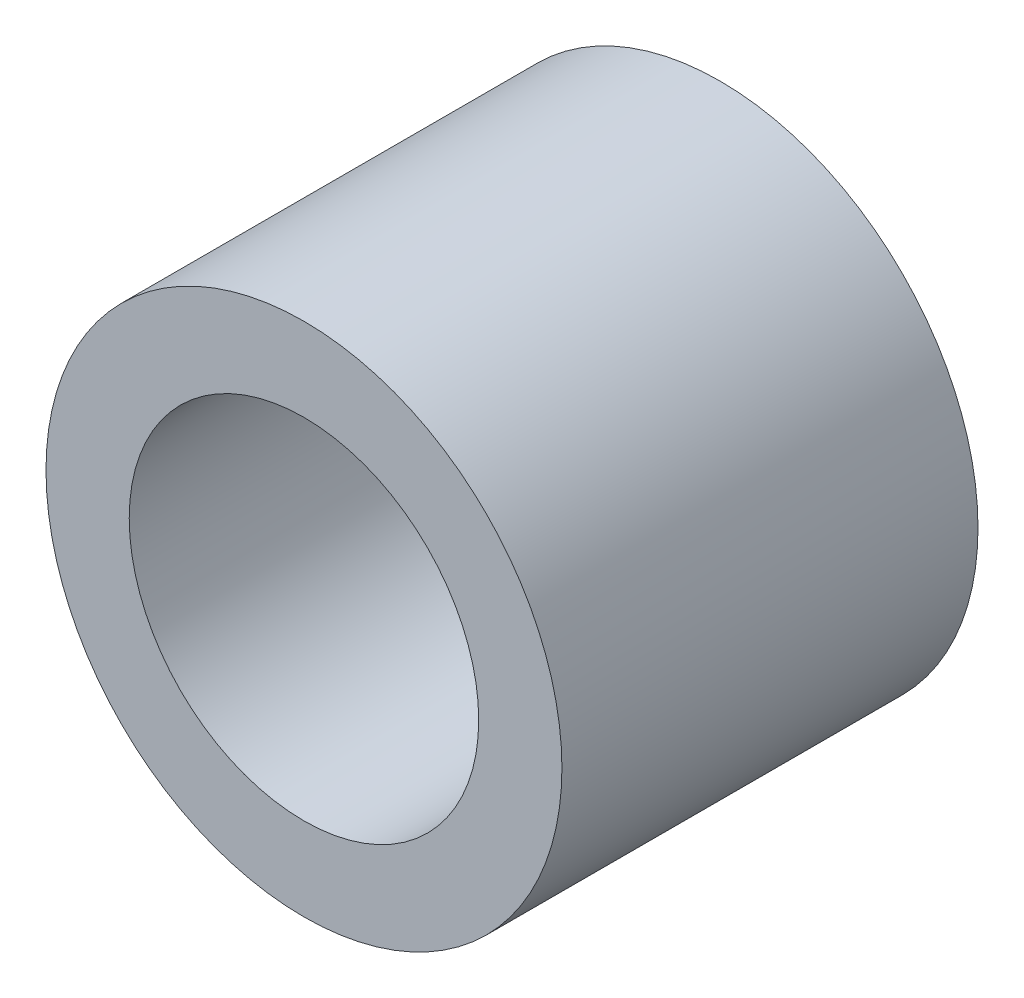
ISO-10303-21;
HEADER;
FILE_DESCRIPTION(('STEP AP214'),'2;1');
FILE_NAME('part.step','',(''),(''),'','','');
FILE_SCHEMA(('AUTOMOTIVE_DESIGN { 1 0 10303 214 1 1 1 1 }'));
ENDSEC;
DATA;
#1=APPLICATION_CONTEXT('core data for automotive mechanical design processes');
#2=APPLICATION_PROTOCOL_DEFINITION('international standard','automotive_design',2000,#1);
#3=PRODUCT_CONTEXT('',#1,'mechanical');
#4=PRODUCT('Part','Part','',(#3));
#5=PRODUCT_RELATED_PRODUCT_CATEGORY('part','',(#4));
#6=PRODUCT_DEFINITION_FORMATION('','',#4);
#7=PRODUCT_DEFINITION_CONTEXT('part definition',#1,'design');
#8=PRODUCT_DEFINITION('design','',#6,#7);
#9=PRODUCT_DEFINITION_SHAPE('','',#8);
#10=(LENGTH_UNIT() NAMED_UNIT(*) SI_UNIT(.MILLI.,.METRE.));
#11=(NAMED_UNIT(*) PLANE_ANGLE_UNIT() SI_UNIT($,.RADIAN.));
#12=(NAMED_UNIT(*) SI_UNIT($,.STERADIAN.) SOLID_ANGLE_UNIT());
#13=UNCERTAINTY_MEASURE_WITH_UNIT(LENGTH_MEASURE(1.E-05),#10,'distance_accuracy_value','');
#14=(GEOMETRIC_REPRESENTATION_CONTEXT(3) GLOBAL_UNCERTAINTY_ASSIGNED_CONTEXT((#13)) GLOBAL_UNIT_ASSIGNED_CONTEXT((#10,
#11,#12)) REPRESENTATION_CONTEXT('',''));
#15=CARTESIAN_POINT('',(0.,0.,0.));
#16=DIRECTION('',(0.,0.,1.));
#17=DIRECTION('',(1.,0.,0.));
#18=AXIS2_PLACEMENT_3D('',#15,#16,#17);
#19=CARTESIAN_POINT('',(0.,0.,5.));
#20=DIRECTION('',(0.,0.,1.));
#21=DIRECTION('',(1.,0.,0.));
#22=AXIS2_PLACEMENT_3D('',#19,#20,#21);
#23=PLANE('',#22);
#24=CARTESIAN_POINT('',(0.,0.,5.));
#25=DIRECTION('',(0.,0.,1.));
#26=DIRECTION('',(1.,0.,0.));
#27=AXIS2_PLACEMENT_3D('',#24,#25,#26);
#28=CIRCLE('',#27,3.1);
#29=CARTESIAN_POINT('',(3.1,0.,5.));
#30=VERTEX_POINT('',#29);
#31=EDGE_CURVE('E10',#30,#30,#28,.T.);
#32=ORIENTED_EDGE('',*,*,#31,.T.);
#33=EDGE_LOOP('',(#32));
#34=FACE_BOUND('',#33,.T.);
#35=CARTESIAN_POINT('',(0.,0.,5.));
#36=DIRECTION('',(0.,0.,1.));
#37=DIRECTION('',(1.,0.,0.));
#38=AXIS2_PLACEMENT_3D('',#35,#36,#37);
#39=CIRCLE('',#38,2.1);
#40=CARTESIAN_POINT('',(2.1,0.,5.));
#41=VERTEX_POINT('',#40);
#42=EDGE_CURVE('E50',#41,#41,#39,.T.);
#43=ORIENTED_EDGE('',*,*,#42,.F.);
#44=EDGE_LOOP('',(#43));
#45=FACE_BOUND('',#44,.T.);
#46=ADVANCED_FACE('F37',(#34,#45),#23,.T.);
#47=CARTESIAN_POINT('',(0.,0.,0.));
#48=DIRECTION('',(0.,0.,1.));
#49=DIRECTION('',(1.,0.,0.));
#50=AXIS2_PLACEMENT_3D('',#47,#48,#49);
#51=PLANE('',#50);
#52=CARTESIAN_POINT('',(0.,0.,0.));
#53=DIRECTION('',(0.,0.,1.));
#54=DIRECTION('',(1.,0.,0.));
#55=AXIS2_PLACEMENT_3D('',#52,#53,#54);
#56=CIRCLE('',#55,3.1);
#57=CARTESIAN_POINT('',(3.1,0.,0.));
#58=VERTEX_POINT('',#57);
#59=EDGE_CURVE('E41',#58,#58,#56,.T.);
#60=ORIENTED_EDGE('',*,*,#59,.F.);
#61=EDGE_LOOP('',(#60));
#62=FACE_BOUND('',#61,.T.);
#63=CARTESIAN_POINT('',(0.,0.,0.));
#64=DIRECTION('',(0.,0.,1.));
#65=DIRECTION('',(1.,0.,0.));
#66=AXIS2_PLACEMENT_3D('',#63,#64,#65);
#67=CIRCLE('',#66,2.1);
#68=CARTESIAN_POINT('',(2.1,0.,0.));
#69=VERTEX_POINT('',#68);
#70=EDGE_CURVE('E52',#69,#69,#67,.T.);
#71=ORIENTED_EDGE('',*,*,#70,.T.);
#72=EDGE_LOOP('',(#71));
#73=FACE_BOUND('',#72,.T.);
#74=ADVANCED_FACE('F64',(#62,#73),#51,.F.);
#75=CARTESIAN_POINT('',(0.,0.,5.));
#76=DIRECTION('',(0.,0.,-1.));
#77=DIRECTION('',(-1.,0.,0.));
#78=AXIS2_PLACEMENT_3D('',#75,#76,#77);
#79=CYLINDRICAL_SURFACE('',#78,3.1);
#80=ORIENTED_EDGE('',*,*,#31,.F.);
#81=EDGE_LOOP('',(#80));
#82=FACE_BOUND('',#81,.T.);
#83=ORIENTED_EDGE('',*,*,#59,.T.);
#84=EDGE_LOOP('',(#83));
#85=FACE_BOUND('',#84,.T.);
#86=ADVANCED_FACE('F39',(#82,#85),#79,.T.);
#87=CARTESIAN_POINT('',(0.,0.,5.));
#88=DIRECTION('',(0.,0.,-1.));
#89=DIRECTION('',(-1.,0.,0.));
#90=AXIS2_PLACEMENT_3D('',#87,#88,#89);
#91=CYLINDRICAL_SURFACE('',#90,2.1);
#92=ORIENTED_EDGE('',*,*,#42,.T.);
#93=EDGE_LOOP('',(#92));
#94=FACE_BOUND('',#93,.T.);
#95=ORIENTED_EDGE('',*,*,#70,.F.);
#96=EDGE_LOOP('',(#95));
#97=FACE_BOUND('',#96,.T.);
#98=ADVANCED_FACE('F60',(#94,#97),#91,.F.);
#99=CLOSED_SHELL('',(#46,#74,#86,#98));
#100=MANIFOLD_SOLID_BREP('B2',#99);
#101=ADVANCED_BREP_SHAPE_REPRESENTATION('',(#18,#100),#14);
#102=SHAPE_DEFINITION_REPRESENTATION(#9,#101);
ENDSEC;
END-ISO-10303-21;
